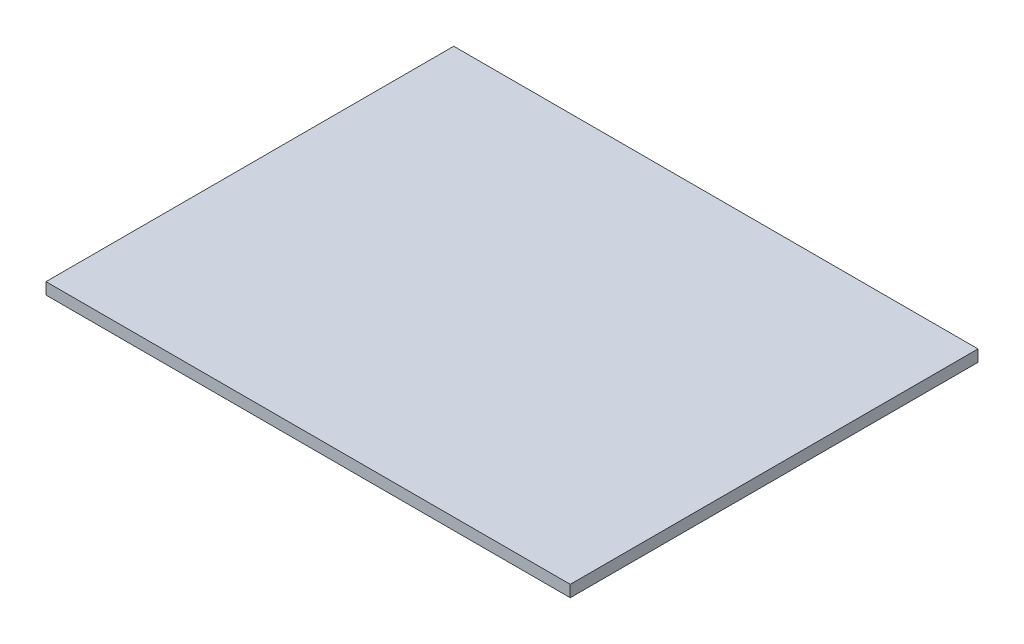
ISO-10303-21;
HEADER;
FILE_DESCRIPTION(('STEP AP214'),'2;1');
FILE_NAME('part.step','',(''),(''),'','','');
FILE_SCHEMA(('AUTOMOTIVE_DESIGN { 1 0 10303 214 1 1 1 1 }'));
ENDSEC;
DATA;
#1=APPLICATION_CONTEXT('core data for automotive mechanical design processes');
#2=APPLICATION_PROTOCOL_DEFINITION('international standard','automotive_design',2000,#1);
#3=PRODUCT_CONTEXT('',#1,'mechanical');
#4=PRODUCT('Part','Part','',(#3));
#5=PRODUCT_RELATED_PRODUCT_CATEGORY('part','',(#4));
#6=PRODUCT_DEFINITION_FORMATION('','',#4);
#7=PRODUCT_DEFINITION_CONTEXT('part definition',#1,'design');
#8=PRODUCT_DEFINITION('design','',#6,#7);
#9=PRODUCT_DEFINITION_SHAPE('','',#8);
#10=(LENGTH_UNIT() NAMED_UNIT(*) SI_UNIT(.MILLI.,.METRE.));
#11=(NAMED_UNIT(*) PLANE_ANGLE_UNIT() SI_UNIT($,.RADIAN.));
#12=(NAMED_UNIT(*) SI_UNIT($,.STERADIAN.) SOLID_ANGLE_UNIT());
#13=UNCERTAINTY_MEASURE_WITH_UNIT(LENGTH_MEASURE(1.E-05),#10,'distance_accuracy_value','');
#14=(GEOMETRIC_REPRESENTATION_CONTEXT(3) GLOBAL_UNCERTAINTY_ASSIGNED_CONTEXT((#13)) GLOBAL_UNIT_ASSIGNED_CONTEXT((#10,
#11,#12)) REPRESENTATION_CONTEXT('',''));
#15=CARTESIAN_POINT('',(0.,0.,0.));
#16=DIRECTION('',(0.,0.,1.));
#17=DIRECTION('',(1.,0.,0.));
#18=AXIS2_PLACEMENT_3D('',#15,#16,#17);
#19=CARTESIAN_POINT('',(45.,2.,-35.));
#20=DIRECTION('',(-1.,0.,0.));
#21=DIRECTION('',(0.,0.,1.));
#22=AXIS2_PLACEMENT_3D('',#19,#20,#21);
#23=PLANE('',#22);
#24=DIRECTION('',(0.,0.,-1.));
#25=VECTOR('',#24,1.);
#26=CARTESIAN_POINT('',(45.,0.,-35.));
#27=LINE('',#26,#25);
#28=CARTESIAN_POINT('',(45.,0.,35.));
#29=VERTEX_POINT('',#28);
#30=CARTESIAN_POINT('',(45.,0.,-35.));
#31=VERTEX_POINT('',#30);
#32=EDGE_CURVE('E111',#29,#31,#27,.T.);
#33=ORIENTED_EDGE('',*,*,#32,.T.);
#34=DIRECTION('',(0.,-1.,0.));
#35=VECTOR('',#34,1.);
#36=CARTESIAN_POINT('',(45.,2.,-35.));
#37=LINE('',#36,#35);
#38=CARTESIAN_POINT('',(45.,2.,-35.));
#39=VERTEX_POINT('',#38);
#40=EDGE_CURVE('E11',#39,#31,#37,.T.);
#41=ORIENTED_EDGE('',*,*,#40,.F.);
#42=DIRECTION('',(0.,0.,-1.));
#43=VECTOR('',#42,1.);
#44=CARTESIAN_POINT('',(45.,2.,-35.));
#45=LINE('',#44,#43);
#46=CARTESIAN_POINT('',(45.,2.,35.));
#47=VERTEX_POINT('',#46);
#48=EDGE_CURVE('E95',#47,#39,#45,.T.);
#49=ORIENTED_EDGE('',*,*,#48,.F.);
#50=DIRECTION('',(0.,-1.,0.));
#51=VECTOR('',#50,1.);
#52=CARTESIAN_POINT('',(45.,2.,35.));
#53=LINE('',#52,#51);
#54=EDGE_CURVE('E107',#47,#29,#53,.T.);
#55=ORIENTED_EDGE('',*,*,#54,.T.);
#56=EDGE_LOOP('',(#33,#41,#49,#55));
#57=FACE_BOUND('',#56,.T.);
#58=ADVANCED_FACE('F43',(#57),#23,.F.);
#59=CARTESIAN_POINT('',(-45.,2.,-35.));
#60=DIRECTION('',(0.,0.,1.));
#61=DIRECTION('',(1.,0.,0.));
#62=AXIS2_PLACEMENT_3D('',#59,#60,#61);
#63=PLANE('',#62);
#64=DIRECTION('',(-1.,0.,0.));
#65=VECTOR('',#64,1.);
#66=CARTESIAN_POINT('',(-45.,0.,-35.));
#67=LINE('',#66,#65);
#68=CARTESIAN_POINT('',(-45.,0.,-35.));
#69=VERTEX_POINT('',#68);
#70=EDGE_CURVE('E100',#31,#69,#67,.T.);
#71=ORIENTED_EDGE('',*,*,#70,.T.);
#72=DIRECTION('',(0.,-1.,0.));
#73=VECTOR('',#72,1.);
#74=CARTESIAN_POINT('',(-45.,2.,-35.));
#75=LINE('',#74,#73);
#76=CARTESIAN_POINT('',(-45.,2.,-35.));
#77=VERTEX_POINT('',#76);
#78=EDGE_CURVE('E52',#77,#69,#75,.T.);
#79=ORIENTED_EDGE('',*,*,#78,.F.);
#80=DIRECTION('',(-1.,0.,0.));
#81=VECTOR('',#80,1.);
#82=CARTESIAN_POINT('',(-45.,2.,-35.));
#83=LINE('',#82,#81);
#84=EDGE_CURVE('E90',#39,#77,#83,.T.);
#85=ORIENTED_EDGE('',*,*,#84,.F.);
#86=ORIENTED_EDGE('',*,*,#40,.T.);
#87=EDGE_LOOP('',(#71,#79,#85,#86));
#88=FACE_BOUND('',#87,.T.);
#89=ADVANCED_FACE('F99',(#88),#63,.F.);
#90=CARTESIAN_POINT('',(-45.,2.,-35.));
#91=DIRECTION('',(1.,0.,0.));
#92=DIRECTION('',(0.,0.,-1.));
#93=AXIS2_PLACEMENT_3D('',#90,#91,#92);
#94=PLANE('',#93);
#95=DIRECTION('',(0.,0.,1.));
#96=VECTOR('',#95,1.);
#97=CARTESIAN_POINT('',(-45.,0.,-35.));
#98=LINE('',#97,#96);
#99=CARTESIAN_POINT('',(-45.,0.,35.));
#100=VERTEX_POINT('',#99);
#101=EDGE_CURVE('E77',#69,#100,#98,.T.);
#102=ORIENTED_EDGE('',*,*,#101,.T.);
#103=DIRECTION('',(0.,-1.,0.));
#104=VECTOR('',#103,1.);
#105=CARTESIAN_POINT('',(-45.,2.,35.));
#106=LINE('',#105,#104);
#107=CARTESIAN_POINT('',(-45.,2.,35.));
#108=VERTEX_POINT('',#107);
#109=EDGE_CURVE('E102',#108,#100,#106,.T.);
#110=ORIENTED_EDGE('',*,*,#109,.F.);
#111=DIRECTION('',(0.,0.,1.));
#112=VECTOR('',#111,1.);
#113=CARTESIAN_POINT('',(-45.,2.,-35.));
#114=LINE('',#113,#112);
#115=EDGE_CURVE('E93',#77,#108,#114,.T.);
#116=ORIENTED_EDGE('',*,*,#115,.F.);
#117=ORIENTED_EDGE('',*,*,#78,.T.);
#118=EDGE_LOOP('',(#102,#110,#116,#117));
#119=FACE_BOUND('',#118,.T.);
#120=ADVANCED_FACE('F103',(#119),#94,.F.);
#121=CARTESIAN_POINT('',(-45.,2.,35.));
#122=DIRECTION('',(0.,0.,-1.));
#123=DIRECTION('',(-1.,0.,0.));
#124=AXIS2_PLACEMENT_3D('',#121,#122,#123);
#125=PLANE('',#124);
#126=DIRECTION('',(1.,0.,0.));
#127=VECTOR('',#126,1.);
#128=CARTESIAN_POINT('',(-45.,0.,35.));
#129=LINE('',#128,#127);
#130=EDGE_CURVE('E83',#100,#29,#129,.T.);
#131=ORIENTED_EDGE('',*,*,#130,.T.);
#132=ORIENTED_EDGE('',*,*,#54,.F.);
#133=DIRECTION('',(1.,0.,0.));
#134=VECTOR('',#133,1.);
#135=CARTESIAN_POINT('',(-45.,2.,35.));
#136=LINE('',#135,#134);
#137=EDGE_CURVE('E60',#108,#47,#136,.T.);
#138=ORIENTED_EDGE('',*,*,#137,.F.);
#139=ORIENTED_EDGE('',*,*,#109,.T.);
#140=EDGE_LOOP('',(#131,#132,#138,#139));
#141=FACE_BOUND('',#140,.T.);
#142=ADVANCED_FACE('F124',(#141),#125,.F.);
#143=CARTESIAN_POINT('',(0.,2.,0.));
#144=DIRECTION('',(0.,1.,0.));
#145=DIRECTION('',(0.,0.,1.));
#146=AXIS2_PLACEMENT_3D('',#143,#144,#145);
#147=PLANE('',#146);
#148=ORIENTED_EDGE('',*,*,#48,.T.);
#149=ORIENTED_EDGE('',*,*,#84,.T.);
#150=ORIENTED_EDGE('',*,*,#115,.T.);
#151=ORIENTED_EDGE('',*,*,#137,.T.);
#152=EDGE_LOOP('',(#148,#149,#150,#151));
#153=FACE_BOUND('',#152,.T.);
#154=ADVANCED_FACE('F91',(#153),#147,.T.);
#155=CARTESIAN_POINT('',(0.,0.,0.));
#156=DIRECTION('',(0.,1.,0.));
#157=DIRECTION('',(0.,0.,1.));
#158=AXIS2_PLACEMENT_3D('',#155,#156,#157);
#159=PLANE('',#158);
#160=ORIENTED_EDGE('',*,*,#32,.F.);
#161=ORIENTED_EDGE('',*,*,#130,.F.);
#162=ORIENTED_EDGE('',*,*,#101,.F.);
#163=ORIENTED_EDGE('',*,*,#70,.F.);
#164=EDGE_LOOP('',(#160,#161,#162,#163));
#165=FACE_BOUND('',#164,.T.);
#166=ADVANCED_FACE('F127',(#165),#159,.F.);
#167=CLOSED_SHELL('',(#58,#89,#120,#142,#154,#166));
#168=MANIFOLD_SOLID_BREP('B2',#167);
#169=ADVANCED_BREP_SHAPE_REPRESENTATION('',(#18,#168),#14);
#170=SHAPE_DEFINITION_REPRESENTATION(#9,#169);
ENDSEC;
END-ISO-10303-21;
